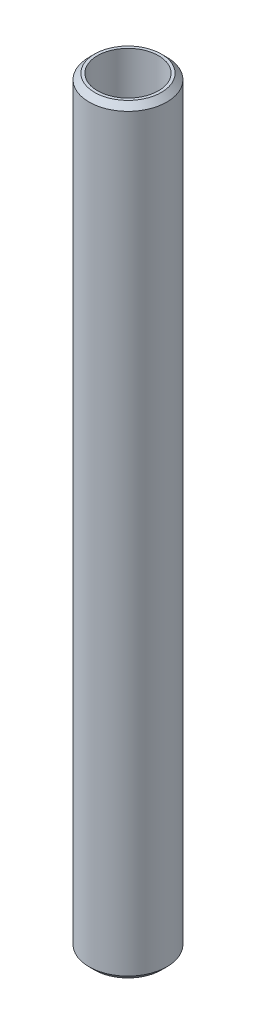
ISO-10303-21;
HEADER;
FILE_DESCRIPTION(('STEP AP214'),'2;1');
FILE_NAME('part.step','',(''),(''),'','','');
FILE_SCHEMA(('AUTOMOTIVE_DESIGN { 1 0 10303 214 1 1 1 1 }'));
ENDSEC;
DATA;
#1=APPLICATION_CONTEXT('core data for automotive mechanical design processes');
#2=APPLICATION_PROTOCOL_DEFINITION('international standard','automotive_design',2000,#1);
#3=PRODUCT_CONTEXT('',#1,'mechanical');
#4=PRODUCT('Part','Part','',(#3));
#5=PRODUCT_RELATED_PRODUCT_CATEGORY('part','',(#4));
#6=PRODUCT_DEFINITION_FORMATION('','',#4);
#7=PRODUCT_DEFINITION_CONTEXT('part definition',#1,'design');
#8=PRODUCT_DEFINITION('design','',#6,#7);
#9=PRODUCT_DEFINITION_SHAPE('','',#8);
#10=(LENGTH_UNIT() NAMED_UNIT(*) SI_UNIT(.MILLI.,.METRE.));
#11=(NAMED_UNIT(*) PLANE_ANGLE_UNIT() SI_UNIT($,.RADIAN.));
#12=(NAMED_UNIT(*) SI_UNIT($,.STERADIAN.) SOLID_ANGLE_UNIT());
#13=UNCERTAINTY_MEASURE_WITH_UNIT(LENGTH_MEASURE(1.E-05),#10,'distance_accuracy_value','');
#14=(GEOMETRIC_REPRESENTATION_CONTEXT(3) GLOBAL_UNCERTAINTY_ASSIGNED_CONTEXT((#13)) GLOBAL_UNIT_ASSIGNED_CONTEXT((#10,
#11,#12)) REPRESENTATION_CONTEXT('',''));
#15=CARTESIAN_POINT('',(0.,0.,0.));
#16=DIRECTION('',(0.,0.,1.));
#17=DIRECTION('',(1.,0.,0.));
#18=AXIS2_PLACEMENT_3D('',#15,#16,#17);
#19=CARTESIAN_POINT('',(0.,390.958241652556,0.));
#20=DIRECTION('',(0.,-1.,0.));
#21=DIRECTION('',(0.,0.,-1.));
#22=AXIS2_PLACEMENT_3D('',#19,#20,#21);
#23=CYLINDRICAL_SURFACE('',#22,20.);
#24=CARTESIAN_POINT('',(0.,388.104794078227,0.));
#25=DIRECTION('',(0.,1.,0.));
#26=DIRECTION('',(0.,0.,1.));
#27=AXIS2_PLACEMENT_3D('',#24,#25,#26);
#28=CIRCLE('',#27,20.);
#29=CARTESIAN_POINT('',(0.,388.104794078227,20.));
#30=VERTEX_POINT('',#29);
#31=EDGE_CURVE('E50',#30,#30,#28,.F.);
#32=ORIENTED_EDGE('',*,*,#31,.T.);
#33=EDGE_LOOP('',(#32));
#34=FACE_BOUND('',#33,.T.);
#35=CARTESIAN_POINT('',(0.,2.85344757432843,0.));
#36=DIRECTION('',(0.,1.,0.));
#37=DIRECTION('',(0.,0.,1.));
#38=AXIS2_PLACEMENT_3D('',#35,#36,#37);
#39=CIRCLE('',#38,20.);
#40=CARTESIAN_POINT('',(0.,2.85344757432843,20.));
#41=VERTEX_POINT('',#40);
#42=EDGE_CURVE('E51',#41,#41,#39,.T.);
#43=ORIENTED_EDGE('',*,*,#42,.T.);
#44=EDGE_LOOP('',(#43));
#45=FACE_BOUND('',#44,.T.);
#46=ADVANCED_FACE('F39',(#34,#45),#23,.T.);
#47=CARTESIAN_POINT('',(0.,390.958241652556,0.));
#48=DIRECTION('',(0.,1.,0.));
#49=DIRECTION('',(0.,0.,1.));
#50=AXIS2_PLACEMENT_3D('',#47,#48,#49);
#51=PLANE('',#50);
#52=CARTESIAN_POINT('',(0.,390.958241652556,0.));
#53=DIRECTION('',(0.,1.,0.));
#54=DIRECTION('',(0.,0.,1.));
#55=AXIS2_PLACEMENT_3D('',#52,#53,#54);
#56=CIRCLE('',#55,17.1465524256715);
#57=CARTESIAN_POINT('',(0.,390.958241652556,17.1465524256715));
#58=VERTEX_POINT('',#57);
#59=EDGE_CURVE('E54',#58,#58,#56,.T.);
#60=ORIENTED_EDGE('',*,*,#59,.T.);
#61=EDGE_LOOP('',(#60));
#62=FACE_BOUND('',#61,.T.);
#63=CARTESIAN_POINT('',(0.,390.958241652556,0.));
#64=DIRECTION('',(0.,1.,0.));
#65=DIRECTION('',(0.,0.,1.));
#66=AXIS2_PLACEMENT_3D('',#63,#64,#65);
#67=CIRCLE('',#66,15.6856703167);
#68=CARTESIAN_POINT('',(0.,390.958241652556,15.6856703167));
#69=VERTEX_POINT('',#68);
#70=EDGE_CURVE('E58',#69,#69,#67,.T.);
#71=ORIENTED_EDGE('',*,*,#70,.F.);
#72=EDGE_LOOP('',(#71));
#73=FACE_BOUND('',#72,.T.);
#74=ADVANCED_FACE('F69',(#62,#73),#51,.T.);
#75=CARTESIAN_POINT('',(0.,0.,0.));
#76=DIRECTION('',(0.,1.,0.));
#77=DIRECTION('',(0.,0.,1.));
#78=AXIS2_PLACEMENT_3D('',#75,#76,#77);
#79=PLANE('',#78);
#80=CARTESIAN_POINT('',(0.,0.,0.));
#81=DIRECTION('',(0.,1.,0.));
#82=DIRECTION('',(0.,0.,1.));
#83=AXIS2_PLACEMENT_3D('',#80,#81,#82);
#84=CIRCLE('',#83,17.1465524256715);
#85=CARTESIAN_POINT('',(0.,0.,17.1465524256715));
#86=VERTEX_POINT('',#85);
#87=EDGE_CURVE('E10',#86,#86,#84,.F.);
#88=ORIENTED_EDGE('',*,*,#87,.T.);
#89=EDGE_LOOP('',(#88));
#90=FACE_BOUND('',#89,.T.);
#91=CARTESIAN_POINT('',(0.,0.,0.));
#92=DIRECTION('',(0.,1.,0.));
#93=DIRECTION('',(0.,0.,1.));
#94=AXIS2_PLACEMENT_3D('',#91,#92,#93);
#95=CIRCLE('',#94,15.6856703167);
#96=CARTESIAN_POINT('',(0.,0.,15.6856703167));
#97=VERTEX_POINT('',#96);
#98=EDGE_CURVE('E63',#97,#97,#95,.T.);
#99=ORIENTED_EDGE('',*,*,#98,.T.);
#100=EDGE_LOOP('',(#99));
#101=FACE_BOUND('',#100,.T.);
#102=ADVANCED_FACE('F75',(#90,#101),#79,.F.);
#103=CARTESIAN_POINT('',(0.,390.958241652556,0.));
#104=DIRECTION('',(0.,-1.,0.));
#105=DIRECTION('',(0.,0.,-1.));
#106=AXIS2_PLACEMENT_3D('',#103,#104,#105);
#107=CYLINDRICAL_SURFACE('',#106,15.6856703167);
#108=ORIENTED_EDGE('',*,*,#70,.T.);
#109=EDGE_LOOP('',(#108));
#110=FACE_BOUND('',#109,.T.);
#111=ORIENTED_EDGE('',*,*,#98,.F.);
#112=EDGE_LOOP('',(#111));
#113=FACE_BOUND('',#112,.T.);
#114=ADVANCED_FACE('F70',(#110,#113),#107,.F.);
#115=CARTESIAN_POINT('',(0.,390.958241652556,0.));
#116=DIRECTION('',(0.,-1.,0.));
#117=DIRECTION('',(0.,0.,-1.));
#118=AXIS2_PLACEMENT_3D('',#115,#116,#117);
#119=CONICAL_SURFACE('',#118,17.1465524256715,0.785398163397445);
#120=ORIENTED_EDGE('',*,*,#31,.F.);
#121=EDGE_LOOP('',(#120));
#122=FACE_BOUND('',#121,.T.);
#123=ORIENTED_EDGE('',*,*,#59,.F.);
#124=EDGE_LOOP('',(#123));
#125=FACE_BOUND('',#124,.T.);
#126=ADVANCED_FACE('F81',(#122,#125),#119,.T.);
#127=CARTESIAN_POINT('',(0.,2.85344757432843,0.));
#128=DIRECTION('',(0.,1.,0.));
#129=DIRECTION('',(0.,0.,1.));
#130=AXIS2_PLACEMENT_3D('',#127,#128,#129);
#131=CONICAL_SURFACE('',#130,20.,0.785398163397455);
#132=ORIENTED_EDGE('',*,*,#87,.F.);
#133=EDGE_LOOP('',(#132));
#134=FACE_BOUND('',#133,.T.);
#135=ORIENTED_EDGE('',*,*,#42,.F.);
#136=EDGE_LOOP('',(#135));
#137=FACE_BOUND('',#136,.T.);
#138=ADVANCED_FACE('F45',(#134,#137),#131,.T.);
#139=CLOSED_SHELL('',(#46,#74,#102,#114,#126,#138));
#140=MANIFOLD_SOLID_BREP('B2',#139);
#141=ADVANCED_BREP_SHAPE_REPRESENTATION('',(#18,#140),#14);
#142=SHAPE_DEFINITION_REPRESENTATION(#9,#141);
ENDSEC;
END-ISO-10303-21;
